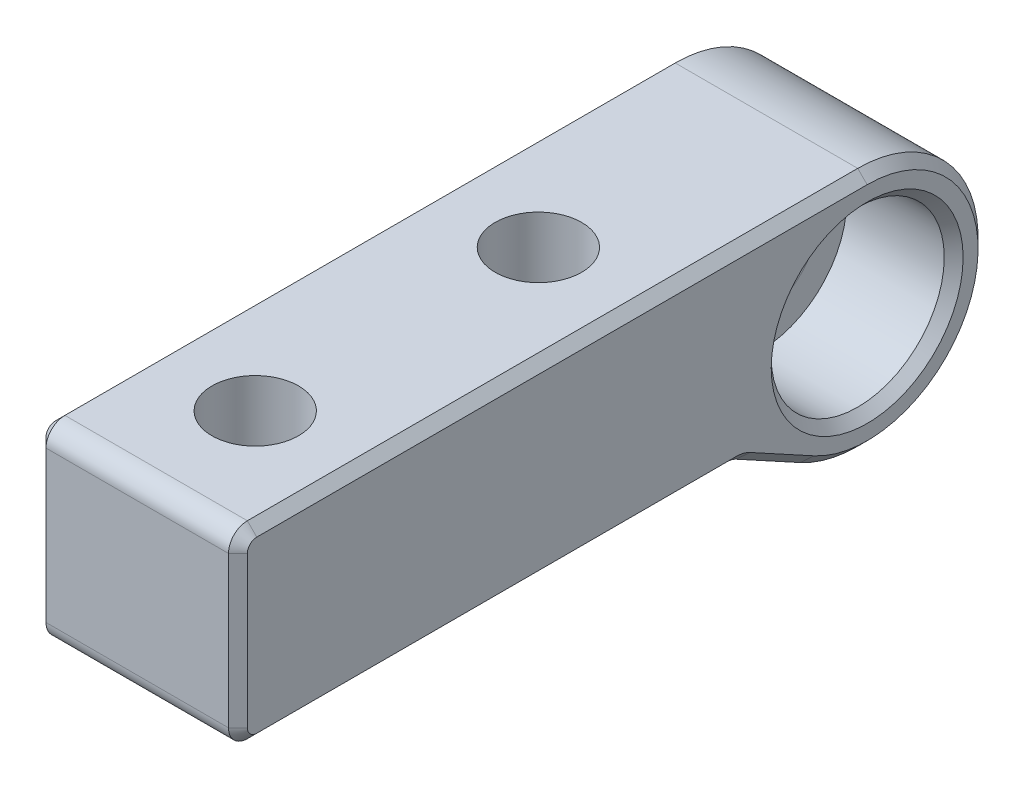
ISO-10303-21;
HEADER;
FILE_DESCRIPTION(('STEP AP214'),'2;1');
FILE_NAME('part.step','',(''),(''),'','','');
FILE_SCHEMA(('AUTOMOTIVE_DESIGN { 1 0 10303 214 1 1 1 1 }'));
ENDSEC;
DATA;
#1=APPLICATION_CONTEXT('core data for automotive mechanical design processes');
#2=APPLICATION_PROTOCOL_DEFINITION('international standard','automotive_design',2000,#1);
#3=PRODUCT_CONTEXT('',#1,'mechanical');
#4=PRODUCT('Part','Part','',(#3));
#5=PRODUCT_RELATED_PRODUCT_CATEGORY('part','',(#4));
#6=PRODUCT_DEFINITION_FORMATION('','',#4);
#7=PRODUCT_DEFINITION_CONTEXT('part definition',#1,'design');
#8=PRODUCT_DEFINITION('design','',#6,#7);
#9=PRODUCT_DEFINITION_SHAPE('','',#8);
#10=(LENGTH_UNIT() NAMED_UNIT(*) SI_UNIT(.MILLI.,.METRE.));
#11=(NAMED_UNIT(*) PLANE_ANGLE_UNIT() SI_UNIT($,.RADIAN.));
#12=(NAMED_UNIT(*) SI_UNIT($,.STERADIAN.) SOLID_ANGLE_UNIT());
#13=UNCERTAINTY_MEASURE_WITH_UNIT(LENGTH_MEASURE(1.E-05),#10,'distance_accuracy_value','');
#14=(GEOMETRIC_REPRESENTATION_CONTEXT(3) GLOBAL_UNCERTAINTY_ASSIGNED_CONTEXT((#13)) GLOBAL_UNIT_ASSIGNED_CONTEXT((#10,
#11,#12)) REPRESENTATION_CONTEXT('',''));
#15=CARTESIAN_POINT('',(0.,0.,0.));
#16=DIRECTION('',(0.,0.,1.));
#17=DIRECTION('',(1.,0.,0.));
#18=AXIS2_PLACEMENT_3D('',#15,#16,#17);
#19=CARTESIAN_POINT('',(12.8,0.,0.));
#20=DIRECTION('',(-1.,0.,0.));
#21=DIRECTION('',(0.,0.,1.));
#22=AXIS2_PLACEMENT_3D('',#19,#20,#21);
#23=CYLINDRICAL_SURFACE('',#22,3.15);
#24=CARTESIAN_POINT('',(5.5,0.,0.));
#25=DIRECTION('',(1.,0.,0.));
#26=DIRECTION('',(0.,0.,-1.));
#27=AXIS2_PLACEMENT_3D('',#24,#25,#26);
#28=CIRCLE('',#27,3.15);
#29=CARTESIAN_POINT('',(5.5,0.,-3.15));
#30=VERTEX_POINT('',#29);
#31=EDGE_CURVE('E45',#30,#30,#28,.T.);
#32=ORIENTED_EDGE('',*,*,#31,.T.);
#33=EDGE_LOOP('',(#32));
#34=FACE_BOUND('',#33,.T.);
#35=CARTESIAN_POINT('',(0.599999999999998,0.,0.));
#36=DIRECTION('',(1.,0.,0.));
#37=DIRECTION('',(0.,0.,-1.));
#38=AXIS2_PLACEMENT_3D('',#35,#36,#37);
#39=CIRCLE('',#38,3.15);
#40=CARTESIAN_POINT('',(0.599999999999998,0.,-3.15));
#41=VERTEX_POINT('',#40);
#42=EDGE_CURVE('E180',#41,#41,#39,.F.);
#43=ORIENTED_EDGE('',*,*,#42,.T.);
#44=EDGE_LOOP('',(#43));
#45=FACE_BOUND('',#44,.T.);
#46=ADVANCED_FACE('F37',(#34,#45),#23,.F.);
#47=CARTESIAN_POINT('',(12.8,0.,0.));
#48=DIRECTION('',(1.,0.,0.));
#49=DIRECTION('',(0.,0.,-1.));
#50=AXIS2_PLACEMENT_3D('',#47,#48,#49);
#51=PLANE('',#50);
#52=DIRECTION('',(0.,-0.478912057387349,-0.877862882965795));
#53=VECTOR('',#52,1.);
#54=CARTESIAN_POINT('',(12.8,-6.18893332490886,3.37633000458081));
#55=LINE('',#54,#53);
#56=CARTESIAN_POINT('',(12.8,-3.96984681066158,7.44399473529363));
#57=VERTEX_POINT('',#56);
#58=CARTESIAN_POINT('',(12.8,-6.18893332490886,3.37633000458081));
#59=VERTEX_POINT('',#58);
#60=EDGE_CURVE('E52',#57,#59,#55,.T.);
#61=ORIENTED_EDGE('',*,*,#60,.T.);
#62=CARTESIAN_POINT('',(12.8,0.,0.));
#63=DIRECTION('',(1.,0.,0.));
#64=DIRECTION('',(0.,0.,-1.));
#65=AXIS2_PLACEMENT_3D('',#62,#63,#64);
#66=CIRCLE('',#65,7.05);
#67=CARTESIAN_POINT('',(12.8,7.05,0.));
#68=VERTEX_POINT('',#67);
#69=EDGE_CURVE('E235',#59,#68,#66,.T.);
#70=ORIENTED_EDGE('',*,*,#69,.T.);
#71=DIRECTION('',(0.,0.,1.));
#72=VECTOR('',#71,1.);
#73=CARTESIAN_POINT('',(12.8,7.05,38.8));
#74=LINE('',#73,#72);
#75=CARTESIAN_POINT('',(12.8,7.05,38.8));
#76=VERTEX_POINT('',#75);
#77=EDGE_CURVE('E223',#68,#76,#74,.T.);
#78=ORIENTED_EDGE('',*,*,#77,.T.);
#79=CARTESIAN_POINT('',(12.8,6.44999999999999,38.8));
#80=DIRECTION('',(1.,0.,0.));
#81=DIRECTION('',(0.,0.,-1.));
#82=AXIS2_PLACEMENT_3D('',#79,#80,#81);
#83=CIRCLE('',#82,0.600000000000003);
#84=CARTESIAN_POINT('',(12.8,6.44999999999999,39.4));
#85=VERTEX_POINT('',#84);
#86=EDGE_CURVE('E225',#76,#85,#83,.T.);
#87=ORIENTED_EDGE('',*,*,#86,.T.);
#88=DIRECTION('',(0.,-1.,0.));
#89=VECTOR('',#88,1.);
#90=CARTESIAN_POINT('',(12.8,-3.15000000000001,39.4));
#91=LINE('',#90,#89);
#92=CARTESIAN_POINT('',(12.8,-3.15000000000001,39.4));
#93=VERTEX_POINT('',#92);
#94=EDGE_CURVE('E227',#85,#93,#91,.T.);
#95=ORIENTED_EDGE('',*,*,#94,.T.);
#96=CARTESIAN_POINT('',(12.8,-3.15000000000001,38.8));
#97=DIRECTION('',(1.,0.,0.));
#98=DIRECTION('',(0.,0.,-1.));
#99=AXIS2_PLACEMENT_3D('',#96,#97,#98);
#100=CIRCLE('',#99,0.600000000000003);
#101=CARTESIAN_POINT('',(12.8,-3.75000000000001,38.8));
#102=VERTEX_POINT('',#101);
#103=EDGE_CURVE('E229',#93,#102,#100,.T.);
#104=ORIENTED_EDGE('',*,*,#103,.T.);
#105=DIRECTION('',(0.,0.,-1.));
#106=VECTOR('',#105,1.);
#107=CARTESIAN_POINT('',(12.8,-3.75000000000001,8.30603643859086));
#108=LINE('',#107,#106);
#109=CARTESIAN_POINT('',(12.8,-3.75000000000001,8.30603643859086));
#110=VERTEX_POINT('',#109);
#111=EDGE_CURVE('E231',#102,#110,#108,.T.);
#112=ORIENTED_EDGE('',*,*,#111,.T.);
#113=CARTESIAN_POINT('',(12.8,-5.55,8.30603643859086));
#114=DIRECTION('',(1.,0.,0.));
#115=DIRECTION('',(0.,0.,-1.));
#116=AXIS2_PLACEMENT_3D('',#113,#114,#115);
#117=CIRCLE('',#116,1.8);
#118=EDGE_CURVE('E57',#110,#57,#117,.F.);
#119=ORIENTED_EDGE('',*,*,#118,.T.);
#120=EDGE_LOOP('',(#61,#70,#78,#87,#95,#104,#112,#119));
#121=FACE_BOUND('',#120,.T.);
#122=CARTESIAN_POINT('',(12.8,0.,0.));
#123=DIRECTION('',(1.,0.,0.));
#124=DIRECTION('',(0.,0.,-1.));
#125=AXIS2_PLACEMENT_3D('',#122,#123,#124);
#126=CIRCLE('',#125,6.10000000000001);
#127=CARTESIAN_POINT('',(12.8,0.,-6.10000000000001));
#128=VERTEX_POINT('',#127);
#129=EDGE_CURVE('E220',#128,#128,#126,.F.);
#130=ORIENTED_EDGE('',*,*,#129,.T.);
#131=EDGE_LOOP('',(#130));
#132=FACE_BOUND('',#131,.T.);
#133=ADVANCED_FACE('F293',(#121,#132),#51,.T.);
#134=CARTESIAN_POINT('',(0.,0.,0.));
#135=DIRECTION('',(1.,0.,0.));
#136=DIRECTION('',(0.,0.,-1.));
#137=AXIS2_PLACEMENT_3D('',#134,#135,#136);
#138=PLANE('',#137);
#139=CARTESIAN_POINT('',(0.,0.,0.));
#140=DIRECTION('',(1.,0.,0.));
#141=DIRECTION('',(0.,0.,-1.));
#142=AXIS2_PLACEMENT_3D('',#139,#140,#141);
#143=CIRCLE('',#142,3.75);
#144=CARTESIAN_POINT('',(0.,0.,-3.75));
#145=VERTEX_POINT('',#144);
#146=EDGE_CURVE('E177',#145,#145,#143,.T.);
#147=ORIENTED_EDGE('',*,*,#146,.T.);
#148=EDGE_LOOP('',(#147));
#149=FACE_BOUND('',#148,.T.);
#150=DIRECTION('',(0.,0.,1.));
#151=VECTOR('',#150,1.);
#152=CARTESIAN_POINT('',(0.,-3.75,0.));
#153=LINE('',#152,#151);
#154=CARTESIAN_POINT('',(0.,-3.75,8.30603643859086));
#155=VERTEX_POINT('',#154);
#156=CARTESIAN_POINT('',(0.,-3.75,38.8));
#157=VERTEX_POINT('',#156);
#158=EDGE_CURVE('E175',#155,#157,#153,.T.);
#159=ORIENTED_EDGE('',*,*,#158,.T.);
#160=CARTESIAN_POINT('',(0.,-3.15000000000001,38.8));
#161=DIRECTION('',(1.,0.,0.));
#162=DIRECTION('',(0.,0.,-1.));
#163=AXIS2_PLACEMENT_3D('',#160,#161,#162);
#164=CIRCLE('',#163,0.599999999999996);
#165=CARTESIAN_POINT('',(0.,-3.15000000000001,39.4));
#166=VERTEX_POINT('',#165);
#167=EDGE_CURVE('E155',#157,#166,#164,.F.);
#168=ORIENTED_EDGE('',*,*,#167,.T.);
#169=DIRECTION('',(0.,1.,0.));
#170=VECTOR('',#169,1.);
#171=CARTESIAN_POINT('',(0.,0.,39.4));
#172=LINE('',#171,#170);
#173=CARTESIAN_POINT('',(0.,6.44999999999999,39.4));
#174=VERTEX_POINT('',#173);
#175=EDGE_CURVE('E164',#166,#174,#172,.T.);
#176=ORIENTED_EDGE('',*,*,#175,.T.);
#177=CARTESIAN_POINT('',(0.,6.44999999999999,38.8));
#178=DIRECTION('',(1.,0.,0.));
#179=DIRECTION('',(0.,0.,-1.));
#180=AXIS2_PLACEMENT_3D('',#177,#178,#179);
#181=CIRCLE('',#180,0.599999999999996);
#182=CARTESIAN_POINT('',(0.,7.04999999999999,38.8));
#183=VERTEX_POINT('',#182);
#184=EDGE_CURVE('E170',#174,#183,#181,.F.);
#185=ORIENTED_EDGE('',*,*,#184,.T.);
#186=DIRECTION('',(0.,0.,-1.));
#187=VECTOR('',#186,1.);
#188=CARTESIAN_POINT('',(0.,7.05,0.));
#189=LINE('',#188,#187);
#190=CARTESIAN_POINT('',(0.,7.05,0.));
#191=VERTEX_POINT('',#190);
#192=EDGE_CURVE('E481',#183,#191,#189,.T.);
#193=ORIENTED_EDGE('',*,*,#192,.T.);
#194=CARTESIAN_POINT('',(0.,0.,0.));
#195=DIRECTION('',(1.,0.,0.));
#196=DIRECTION('',(0.,0.,-1.));
#197=AXIS2_PLACEMENT_3D('',#194,#195,#196);
#198=CIRCLE('',#197,7.05);
#199=CARTESIAN_POINT('',(0.,-6.18893332490885,3.37633000458081));
#200=VERTEX_POINT('',#199);
#201=EDGE_CURVE('E483',#191,#200,#198,.F.);
#202=ORIENTED_EDGE('',*,*,#201,.T.);
#203=DIRECTION('',(0.,0.478912057387349,0.877862882965795));
#204=VECTOR('',#203,1.);
#205=CARTESIAN_POINT('',(0.,-6.18893332490885,3.37633000458081));
#206=LINE('',#205,#204);
#207=CARTESIAN_POINT('',(0.,-3.96984681066157,7.44399473529363));
#208=VERTEX_POINT('',#207);
#209=EDGE_CURVE('E485',#200,#208,#206,.T.);
#210=ORIENTED_EDGE('',*,*,#209,.T.);
#211=CARTESIAN_POINT('',(0.,-5.55,8.30603643859086));
#212=DIRECTION('',(1.,0.,0.));
#213=DIRECTION('',(0.,0.,-1.));
#214=AXIS2_PLACEMENT_3D('',#211,#212,#213);
#215=CIRCLE('',#214,1.8);
#216=EDGE_CURVE('E182',#208,#155,#215,.T.);
#217=ORIENTED_EDGE('',*,*,#216,.T.);
#218=EDGE_LOOP('',(#159,#168,#176,#185,#193,#202,#210,#217));
#219=FACE_BOUND('',#218,.T.);
#220=ADVANCED_FACE('F173',(#149,#219),#138,.F.);
#221=CARTESIAN_POINT('',(12.8,-4.35,8.));
#222=DIRECTION('',(0.,1.,0.));
#223=DIRECTION('',(0.,0.,1.));
#224=AXIS2_PLACEMENT_3D('',#221,#222,#223);
#225=PLANE('',#224);
#226=CARTESIAN_POINT('',(6.4,-4.35,14.5));
#227=DIRECTION('',(0.,-1.,0.));
#228=DIRECTION('',(0.,0.,-1.));
#229=AXIS2_PLACEMENT_3D('',#226,#227,#228);
#230=CIRCLE('',#229,5.);
#231=CARTESIAN_POINT('',(6.4,-4.35,9.5));
#232=VERTEX_POINT('',#231);
#233=EDGE_CURVE('E531',#232,#232,#230,.T.);
#234=ORIENTED_EDGE('',*,*,#233,.F.);
#235=EDGE_LOOP('',(#234));
#236=FACE_BOUND('',#235,.T.);
#237=CARTESIAN_POINT('',(6.4,-4.35000000000001,32.5));
#238=DIRECTION('',(0.,-1.,0.));
#239=DIRECTION('',(0.,0.,-1.));
#240=AXIS2_PLACEMENT_3D('',#237,#238,#239);
#241=CIRCLE('',#240,5.);
#242=CARTESIAN_POINT('',(6.4,-4.35000000000001,27.5));
#243=VERTEX_POINT('',#242);
#244=EDGE_CURVE('E519',#243,#243,#241,.T.);
#245=ORIENTED_EDGE('',*,*,#244,.F.);
#246=EDGE_LOOP('',(#245));
#247=FACE_BOUND('',#246,.T.);
#248=DIRECTION('',(-1.,0.,0.));
#249=VECTOR('',#248,1.);
#250=CARTESIAN_POINT('',(12.8,-4.35000000000001,38.8));
#251=LINE('',#250,#249);
#252=CARTESIAN_POINT('',(12.2,-4.35000000000001,38.8));
#253=VERTEX_POINT('',#252);
#254=CARTESIAN_POINT('',(0.600000000000003,-4.35000000000001,38.8));
#255=VERTEX_POINT('',#254);
#256=EDGE_CURVE('E497',#253,#255,#251,.T.);
#257=ORIENTED_EDGE('',*,*,#256,.T.);
#258=DIRECTION('',(0.,0.,-1.));
#259=VECTOR('',#258,1.);
#260=CARTESIAN_POINT('',(0.600000000000003,-4.35,8.));
#261=LINE('',#260,#259);
#262=CARTESIAN_POINT('',(0.600000000000003,-4.35,8.30603643859086));
#263=VERTEX_POINT('',#262);
#264=EDGE_CURVE('E193',#255,#263,#261,.T.);
#265=ORIENTED_EDGE('',*,*,#264,.T.);
#266=DIRECTION('',(-1.,0.,0.));
#267=VECTOR('',#266,1.);
#268=CARTESIAN_POINT('',(12.8,-4.35,8.30603643859086));
#269=LINE('',#268,#267);
#270=CARTESIAN_POINT('',(12.2,-4.35,8.30603643859086));
#271=VERTEX_POINT('',#270);
#272=EDGE_CURVE('E476',#263,#271,#269,.F.);
#273=ORIENTED_EDGE('',*,*,#272,.T.);
#274=DIRECTION('',(0.,0.,1.));
#275=VECTOR('',#274,1.);
#276=CARTESIAN_POINT('',(12.2,-4.35000000000001,38.8));
#277=LINE('',#276,#275);
#278=EDGE_CURVE('E191',#271,#253,#277,.T.);
#279=ORIENTED_EDGE('',*,*,#278,.T.);
#280=EDGE_LOOP('',(#257,#265,#273,#279));
#281=FACE_BOUND('',#280,.T.);
#282=ADVANCED_FACE('F305',(#236,#247,#281),#225,.F.);
#283=CARTESIAN_POINT('',(12.8,-4.35,8.));
#284=DIRECTION('',(0.,0.877862882965795,-0.478912057387349));
#285=DIRECTION('',(0.,0.478912057387349,0.877862882965795));
#286=AXIS2_PLACEMENT_3D('',#283,#284,#285);
#287=PLANE('',#286);
#288=DIRECTION('',(-1.,0.,0.));
#289=VECTOR('',#288,1.);
#290=CARTESIAN_POINT('',(0.,-4.49656454044105,7.73134196972604));
#291=LINE('',#290,#289);
#292=CARTESIAN_POINT('',(12.2,-4.49656454044105,7.73134196972604));
#293=VERTEX_POINT('',#292);
#294=CARTESIAN_POINT('',(0.600000000000003,-4.49656454044105,7.73134196972604));
#295=VERTEX_POINT('',#294);
#296=EDGE_CURVE('E499',#293,#295,#291,.T.);
#297=ORIENTED_EDGE('',*,*,#296,.T.);
#298=DIRECTION('',(0.,-0.478912057387349,-0.877862882965795));
#299=VECTOR('',#298,1.);
#300=CARTESIAN_POINT('',(0.600000000000003,-4.35,8.));
#301=LINE('',#300,#299);
#302=CARTESIAN_POINT('',(0.600000000000003,-6.71565105468833,3.66367723901322));
#303=VERTEX_POINT('',#302);
#304=EDGE_CURVE('E201',#295,#303,#301,.T.);
#305=ORIENTED_EDGE('',*,*,#304,.T.);
#306=DIRECTION('',(-1.,0.,0.));
#307=VECTOR('',#306,1.);
#308=CARTESIAN_POINT('',(12.8,-6.71565105468833,3.66367723901322));
#309=LINE('',#308,#307);
#310=CARTESIAN_POINT('',(12.2,-6.71565105468833,3.66367723901322));
#311=VERTEX_POINT('',#310);
#312=EDGE_CURVE('E502',#311,#303,#309,.T.);
#313=ORIENTED_EDGE('',*,*,#312,.F.);
#314=DIRECTION('',(0.,0.478912057387349,0.877862882965795));
#315=VECTOR('',#314,1.);
#316=CARTESIAN_POINT('',(12.2,-4.49656454044105,7.73134196972604));
#317=LINE('',#316,#315);
#318=EDGE_CURVE('E199',#311,#293,#317,.T.);
#319=ORIENTED_EDGE('',*,*,#318,.T.);
#320=EDGE_LOOP('',(#297,#305,#313,#319));
#321=FACE_BOUND('',#320,.T.);
#322=ADVANCED_FACE('F318',(#321),#287,.F.);
#323=CARTESIAN_POINT('',(12.8,0.,0.));
#324=DIRECTION('',(-1.,0.,0.));
#325=DIRECTION('',(0.,0.,1.));
#326=AXIS2_PLACEMENT_3D('',#323,#324,#325);
#327=CYLINDRICAL_SURFACE('',#326,7.65);
#328=ORIENTED_EDGE('',*,*,#312,.T.);
#329=CARTESIAN_POINT('',(0.600000000000003,0.,0.));
#330=DIRECTION('',(1.,0.,0.));
#331=DIRECTION('',(0.,0.,-1.));
#332=AXIS2_PLACEMENT_3D('',#329,#330,#331);
#333=CIRCLE('',#332,7.65);
#334=CARTESIAN_POINT('',(0.600000000000003,7.65,0.));
#335=VERTEX_POINT('',#334);
#336=EDGE_CURVE('E206',#303,#335,#333,.T.);
#337=ORIENTED_EDGE('',*,*,#336,.T.);
#338=DIRECTION('',(-1.,0.,0.));
#339=VECTOR('',#338,1.);
#340=CARTESIAN_POINT('',(12.8,7.65,0.));
#341=LINE('',#340,#339);
#342=CARTESIAN_POINT('',(12.2,7.65,0.));
#343=VERTEX_POINT('',#342);
#344=EDGE_CURVE('E507',#343,#335,#341,.T.);
#345=ORIENTED_EDGE('',*,*,#344,.F.);
#346=CARTESIAN_POINT('',(12.2,0.,0.));
#347=DIRECTION('',(1.,0.,0.));
#348=DIRECTION('',(0.,0.,-1.));
#349=AXIS2_PLACEMENT_3D('',#346,#347,#348);
#350=CIRCLE('',#349,7.65);
#351=EDGE_CURVE('E203',#343,#311,#350,.F.);
#352=ORIENTED_EDGE('',*,*,#351,.T.);
#353=EDGE_LOOP('',(#328,#337,#345,#352));
#354=FACE_BOUND('',#353,.T.);
#355=ADVANCED_FACE('F314',(#354),#327,.T.);
#356=CARTESIAN_POINT('',(12.8,7.65,0.));
#357=DIRECTION('',(0.,-1.,0.));
#358=DIRECTION('',(0.,0.,-1.));
#359=AXIS2_PLACEMENT_3D('',#356,#357,#358);
#360=PLANE('',#359);
#361=CARTESIAN_POINT('',(6.4,7.65,14.5));
#362=DIRECTION('',(0.,-1.,0.));
#363=DIRECTION('',(0.,0.,-1.));
#364=AXIS2_PLACEMENT_3D('',#361,#362,#363);
#365=CIRCLE('',#364,2.75);
#366=CARTESIAN_POINT('',(6.4,7.65,11.75));
#367=VERTEX_POINT('',#366);
#368=EDGE_CURVE('E522',#367,#367,#365,.T.);
#369=ORIENTED_EDGE('',*,*,#368,.T.);
#370=EDGE_LOOP('',(#369));
#371=FACE_BOUND('',#370,.T.);
#372=CARTESIAN_POINT('',(6.4,7.65,32.5));
#373=DIRECTION('',(0.,-1.,0.));
#374=DIRECTION('',(0.,0.,-1.));
#375=AXIS2_PLACEMENT_3D('',#372,#373,#374);
#376=CIRCLE('',#375,2.75);
#377=CARTESIAN_POINT('',(6.4,7.65,29.75));
#378=VERTEX_POINT('',#377);
#379=EDGE_CURVE('E510',#378,#378,#376,.T.);
#380=ORIENTED_EDGE('',*,*,#379,.T.);
#381=EDGE_LOOP('',(#380));
#382=FACE_BOUND('',#381,.T.);
#383=ORIENTED_EDGE('',*,*,#344,.T.);
#384=DIRECTION('',(0.,0.,1.));
#385=VECTOR('',#384,1.);
#386=CARTESIAN_POINT('',(0.600000000000003,7.65,0.));
#387=LINE('',#386,#385);
#388=CARTESIAN_POINT('',(0.600000000000003,7.64999999999999,38.8));
#389=VERTEX_POINT('',#388);
#390=EDGE_CURVE('E210',#335,#389,#387,.T.);
#391=ORIENTED_EDGE('',*,*,#390,.T.);
#392=DIRECTION('',(-1.,0.,0.));
#393=VECTOR('',#392,1.);
#394=CARTESIAN_POINT('',(12.8,7.64999999999999,38.8));
#395=LINE('',#394,#393);
#396=CARTESIAN_POINT('',(12.2,7.64999999999999,38.8));
#397=VERTEX_POINT('',#396);
#398=EDGE_CURVE('E171',#389,#397,#395,.F.);
#399=ORIENTED_EDGE('',*,*,#398,.T.);
#400=DIRECTION('',(0.,0.,-1.));
#401=VECTOR('',#400,1.);
#402=CARTESIAN_POINT('',(12.2,7.65,0.));
#403=LINE('',#402,#401);
#404=EDGE_CURVE('E208',#397,#343,#403,.T.);
#405=ORIENTED_EDGE('',*,*,#404,.T.);
#406=EDGE_LOOP('',(#383,#391,#399,#405));
#407=FACE_BOUND('',#406,.T.);
#408=ADVANCED_FACE('F310',(#371,#382,#407),#360,.F.);
#409=CARTESIAN_POINT('',(12.8,-4.35000000000001,40.));
#410=DIRECTION('',(0.,0.,-1.));
#411=DIRECTION('',(-1.,0.,0.));
#412=AXIS2_PLACEMENT_3D('',#409,#410,#411);
#413=PLANE('',#412);
#414=DIRECTION('',(-1.,0.,0.));
#415=VECTOR('',#414,1.);
#416=CARTESIAN_POINT('',(12.8,6.44999999999999,40.));
#417=LINE('',#416,#415);
#418=CARTESIAN_POINT('',(12.2,6.44999999999999,40.));
#419=VERTEX_POINT('',#418);
#420=CARTESIAN_POINT('',(0.600000000000003,6.44999999999999,40.));
#421=VERTEX_POINT('',#420);
#422=EDGE_CURVE('E468',#419,#421,#417,.T.);
#423=ORIENTED_EDGE('',*,*,#422,.T.);
#424=DIRECTION('',(0.,-1.,0.));
#425=VECTOR('',#424,1.);
#426=CARTESIAN_POINT('',(0.600000000000003,-4.35000000000001,40.));
#427=LINE('',#426,#425);
#428=CARTESIAN_POINT('',(0.600000000000003,-3.15000000000001,40.));
#429=VERTEX_POINT('',#428);
#430=EDGE_CURVE('E218',#421,#429,#427,.T.);
#431=ORIENTED_EDGE('',*,*,#430,.T.);
#432=DIRECTION('',(-1.,0.,0.));
#433=VECTOR('',#432,1.);
#434=CARTESIAN_POINT('',(12.8,-3.15000000000001,40.));
#435=LINE('',#434,#433);
#436=CARTESIAN_POINT('',(12.2,-3.15000000000001,40.));
#437=VERTEX_POINT('',#436);
#438=EDGE_CURVE('E470',#429,#437,#435,.F.);
#439=ORIENTED_EDGE('',*,*,#438,.T.);
#440=DIRECTION('',(0.,1.,0.));
#441=VECTOR('',#440,1.);
#442=CARTESIAN_POINT('',(12.2,6.44999999999999,40.));
#443=LINE('',#442,#441);
#444=EDGE_CURVE('E216',#437,#419,#443,.T.);
#445=ORIENTED_EDGE('',*,*,#444,.T.);
#446=EDGE_LOOP('',(#423,#431,#439,#445));
#447=FACE_BOUND('',#446,.T.);
#448=ADVANCED_FACE('F307',(#447),#413,.F.);
#449=CARTESIAN_POINT('',(6.4,-4.35000000000001,32.5));
#450=DIRECTION('',(0.,-1.,0.));
#451=DIRECTION('',(0.,0.,-1.));
#452=AXIS2_PLACEMENT_3D('',#449,#450,#451);
#453=CYLINDRICAL_SURFACE('',#452,2.75);
#454=ORIENTED_EDGE('',*,*,#379,.F.);
#455=EDGE_LOOP('',(#454));
#456=FACE_BOUND('',#455,.T.);
#457=CARTESIAN_POINT('',(6.4,1.14999999999999,32.5));
#458=DIRECTION('',(0.,-1.,0.));
#459=DIRECTION('',(0.,0.,-1.));
#460=AXIS2_PLACEMENT_3D('',#457,#458,#459);
#461=CIRCLE('',#460,2.75);
#462=CARTESIAN_POINT('',(6.4,1.14999999999999,29.75));
#463=VERTEX_POINT('',#462);
#464=EDGE_CURVE('E513',#463,#463,#461,.T.);
#465=ORIENTED_EDGE('',*,*,#464,.T.);
#466=EDGE_LOOP('',(#465));
#467=FACE_BOUND('',#466,.T.);
#468=ADVANCED_FACE('F300',(#456,#467),#453,.F.);
#469=CARTESIAN_POINT('',(9.15,1.14999999999999,32.5));
#470=DIRECTION('',(0.,1.,0.));
#471=DIRECTION('',(0.,0.,1.));
#472=AXIS2_PLACEMENT_3D('',#469,#470,#471);
#473=PLANE('',#472);
#474=ORIENTED_EDGE('',*,*,#464,.F.);
#475=EDGE_LOOP('',(#474));
#476=FACE_BOUND('',#475,.T.);
#477=CARTESIAN_POINT('',(6.4,1.14999999999999,32.5));
#478=DIRECTION('',(0.,-1.,0.));
#479=DIRECTION('',(0.,0.,-1.));
#480=AXIS2_PLACEMENT_3D('',#477,#478,#479);
#481=CIRCLE('',#480,5.);
#482=CARTESIAN_POINT('',(6.4,1.14999999999999,27.5));
#483=VERTEX_POINT('',#482);
#484=EDGE_CURVE('E516',#483,#483,#481,.T.);
#485=ORIENTED_EDGE('',*,*,#484,.T.);
#486=EDGE_LOOP('',(#485));
#487=FACE_BOUND('',#486,.T.);
#488=ADVANCED_FACE('F562',(#476,#487),#473,.F.);
#489=CARTESIAN_POINT('',(6.4,-4.35000000000001,32.5));
#490=DIRECTION('',(0.,-1.,0.));
#491=DIRECTION('',(0.,0.,-1.));
#492=AXIS2_PLACEMENT_3D('',#489,#490,#491);
#493=CYLINDRICAL_SURFACE('',#492,5.);
#494=ORIENTED_EDGE('',*,*,#484,.F.);
#495=EDGE_LOOP('',(#494));
#496=FACE_BOUND('',#495,.T.);
#497=ORIENTED_EDGE('',*,*,#244,.T.);
#498=EDGE_LOOP('',(#497));
#499=FACE_BOUND('',#498,.T.);
#500=ADVANCED_FACE('F559',(#496,#499),#493,.F.);
#501=CARTESIAN_POINT('',(6.4,-4.35,14.5));
#502=DIRECTION('',(0.,-1.,0.));
#503=DIRECTION('',(0.,0.,-1.));
#504=AXIS2_PLACEMENT_3D('',#501,#502,#503);
#505=CYLINDRICAL_SURFACE('',#504,2.75);
#506=ORIENTED_EDGE('',*,*,#368,.F.);
#507=EDGE_LOOP('',(#506));
#508=FACE_BOUND('',#507,.T.);
#509=CARTESIAN_POINT('',(6.4,1.15,14.5));
#510=DIRECTION('',(0.,-1.,0.));
#511=DIRECTION('',(0.,0.,-1.));
#512=AXIS2_PLACEMENT_3D('',#509,#510,#511);
#513=CIRCLE('',#512,2.75);
#514=CARTESIAN_POINT('',(6.4,1.15,11.75));
#515=VERTEX_POINT('',#514);
#516=EDGE_CURVE('E525',#515,#515,#513,.T.);
#517=ORIENTED_EDGE('',*,*,#516,.T.);
#518=EDGE_LOOP('',(#517));
#519=FACE_BOUND('',#518,.T.);
#520=ADVANCED_FACE('F555',(#508,#519),#505,.F.);
#521=CARTESIAN_POINT('',(9.15,1.15,14.5));
#522=DIRECTION('',(0.,1.,0.));
#523=DIRECTION('',(0.,0.,1.));
#524=AXIS2_PLACEMENT_3D('',#521,#522,#523);
#525=PLANE('',#524);
#526=ORIENTED_EDGE('',*,*,#516,.F.);
#527=EDGE_LOOP('',(#526));
#528=FACE_BOUND('',#527,.T.);
#529=CARTESIAN_POINT('',(6.4,1.15,14.5));
#530=DIRECTION('',(0.,-1.,0.));
#531=DIRECTION('',(0.,0.,-1.));
#532=AXIS2_PLACEMENT_3D('',#529,#530,#531);
#533=CIRCLE('',#532,5.);
#534=CARTESIAN_POINT('',(6.4,1.15,9.50000000000001));
#535=VERTEX_POINT('',#534);
#536=EDGE_CURVE('E528',#535,#535,#533,.T.);
#537=ORIENTED_EDGE('',*,*,#536,.T.);
#538=EDGE_LOOP('',(#537));
#539=FACE_BOUND('',#538,.T.);
#540=ADVANCED_FACE('F551',(#528,#539),#525,.F.);
#541=CARTESIAN_POINT('',(6.4,-4.35,14.5));
#542=DIRECTION('',(0.,-1.,0.));
#543=DIRECTION('',(0.,0.,-1.));
#544=AXIS2_PLACEMENT_3D('',#541,#542,#543);
#545=CYLINDRICAL_SURFACE('',#544,5.);
#546=ORIENTED_EDGE('',*,*,#536,.F.);
#547=EDGE_LOOP('',(#546));
#548=FACE_BOUND('',#547,.T.);
#549=ORIENTED_EDGE('',*,*,#233,.T.);
#550=EDGE_LOOP('',(#549));
#551=FACE_BOUND('',#550,.T.);
#552=ADVANCED_FACE('F545',(#548,#551),#545,.F.);
#553=CARTESIAN_POINT('',(-15.556349186104,0.,0.));
#554=DIRECTION('',(1.,0.,0.));
#555=DIRECTION('',(0.,0.,-1.));
#556=AXIS2_PLACEMENT_3D('',#553,#554,#555);
#557=CYLINDRICAL_SURFACE('',#556,5.5);
#558=CARTESIAN_POINT('',(12.2,0.,0.));
#559=DIRECTION('',(1.,0.,0.));
#560=DIRECTION('',(0.,0.,-1.));
#561=AXIS2_PLACEMENT_3D('',#558,#559,#560);
#562=CIRCLE('',#561,5.5);
#563=CARTESIAN_POINT('',(12.2,0.,-5.5));
#564=VERTEX_POINT('',#563);
#565=EDGE_CURVE('E237',#564,#564,#562,.T.);
#566=ORIENTED_EDGE('',*,*,#565,.T.);
#567=EDGE_LOOP('',(#566));
#568=FACE_BOUND('',#567,.T.);
#569=CARTESIAN_POINT('',(6.,0.,0.));
#570=DIRECTION('',(1.,0.,0.));
#571=DIRECTION('',(0.,0.,-1.));
#572=AXIS2_PLACEMENT_3D('',#569,#570,#571);
#573=CIRCLE('',#572,5.5);
#574=CARTESIAN_POINT('',(6.,0.,-5.5));
#575=VERTEX_POINT('',#574);
#576=EDGE_CURVE('E257',#575,#575,#573,.F.);
#577=ORIENTED_EDGE('',*,*,#576,.T.);
#578=EDGE_LOOP('',(#577));
#579=FACE_BOUND('',#578,.T.);
#580=ADVANCED_FACE('F537',(#568,#579),#557,.F.);
#581=CARTESIAN_POINT('',(6.,0.,0.));
#582=DIRECTION('',(1.,0.,0.));
#583=DIRECTION('',(0.,0.,-1.));
#584=AXIS2_PLACEMENT_3D('',#581,#582,#583);
#585=PLANE('',#584);
#586=CARTESIAN_POINT('',(6.,0.,0.));
#587=DIRECTION('',(1.,0.,0.));
#588=DIRECTION('',(0.,0.,-1.));
#589=AXIS2_PLACEMENT_3D('',#586,#587,#588);
#590=CIRCLE('',#589,3.65);
#591=CARTESIAN_POINT('',(6.,0.,-3.65));
#592=VERTEX_POINT('',#591);
#593=EDGE_CURVE('E12',#592,#592,#590,.F.);
#594=ORIENTED_EDGE('',*,*,#593,.T.);
#595=EDGE_LOOP('',(#594));
#596=FACE_BOUND('',#595,.T.);
#597=ORIENTED_EDGE('',*,*,#576,.F.);
#598=EDGE_LOOP('',(#597));
#599=FACE_BOUND('',#598,.T.);
#600=ADVANCED_FACE('F330',(#596,#599),#585,.T.);
#601=CARTESIAN_POINT('',(12.8,-5.55,8.30603643859086));
#602=DIRECTION('',(1.,0.,0.));
#603=DIRECTION('',(0.,0.,-1.));
#604=AXIS2_PLACEMENT_3D('',#601,#602,#603);
#605=CYLINDRICAL_SURFACE('',#604,1.2);
#606=ORIENTED_EDGE('',*,*,#272,.F.);
#607=CARTESIAN_POINT('',(0.600000000000003,-5.55,8.30603643859086));
#608=DIRECTION('',(1.,0.,0.));
#609=DIRECTION('',(0.,0.,-1.));
#610=AXIS2_PLACEMENT_3D('',#607,#608,#609);
#611=CIRCLE('',#610,1.2);
#612=EDGE_CURVE('E197',#263,#295,#611,.F.);
#613=ORIENTED_EDGE('',*,*,#612,.T.);
#614=ORIENTED_EDGE('',*,*,#296,.F.);
#615=CARTESIAN_POINT('',(12.2,-5.55,8.30603643859086));
#616=DIRECTION('',(1.,0.,0.));
#617=DIRECTION('',(0.,0.,-1.));
#618=AXIS2_PLACEMENT_3D('',#615,#616,#617);
#619=CIRCLE('',#618,1.2);
#620=EDGE_CURVE('E195',#293,#271,#619,.T.);
#621=ORIENTED_EDGE('',*,*,#620,.T.);
#622=EDGE_LOOP('',(#606,#613,#614,#621));
#623=FACE_BOUND('',#622,.T.);
#624=ADVANCED_FACE('F326',(#623),#605,.F.);
#625=CARTESIAN_POINT('',(12.8,6.44999999999999,38.8));
#626=DIRECTION('',(-1.,0.,0.));
#627=DIRECTION('',(0.,0.,1.));
#628=AXIS2_PLACEMENT_3D('',#625,#626,#627);
#629=CYLINDRICAL_SURFACE('',#628,1.2);
#630=ORIENTED_EDGE('',*,*,#398,.F.);
#631=CARTESIAN_POINT('',(0.600000000000003,6.44999999999999,38.8));
#632=DIRECTION('',(1.,0.,0.));
#633=DIRECTION('',(0.,0.,-1.));
#634=AXIS2_PLACEMENT_3D('',#631,#632,#633);
#635=CIRCLE('',#634,1.2);
#636=EDGE_CURVE('E214',#389,#421,#635,.T.);
#637=ORIENTED_EDGE('',*,*,#636,.T.);
#638=ORIENTED_EDGE('',*,*,#422,.F.);
#639=CARTESIAN_POINT('',(12.2,6.44999999999999,38.8));
#640=DIRECTION('',(1.,0.,0.));
#641=DIRECTION('',(0.,0.,-1.));
#642=AXIS2_PLACEMENT_3D('',#639,#640,#641);
#643=CIRCLE('',#642,1.2);
#644=EDGE_CURVE('E212',#419,#397,#643,.F.);
#645=ORIENTED_EDGE('',*,*,#644,.T.);
#646=EDGE_LOOP('',(#630,#637,#638,#645));
#647=FACE_BOUND('',#646,.T.);
#648=ADVANCED_FACE('F329',(#647),#629,.T.);
#649=CARTESIAN_POINT('',(12.8,-3.15000000000001,38.8));
#650=DIRECTION('',(-1.,0.,0.));
#651=DIRECTION('',(0.,0.,1.));
#652=AXIS2_PLACEMENT_3D('',#649,#650,#651);
#653=CYLINDRICAL_SURFACE('',#652,1.2);
#654=ORIENTED_EDGE('',*,*,#438,.F.);
#655=CARTESIAN_POINT('',(0.600000000000003,-3.15000000000001,38.8));
#656=DIRECTION('',(1.,0.,0.));
#657=DIRECTION('',(0.,0.,-1.));
#658=AXIS2_PLACEMENT_3D('',#655,#656,#657);
#659=CIRCLE('',#658,1.2);
#660=EDGE_CURVE('E157',#429,#255,#659,.T.);
#661=ORIENTED_EDGE('',*,*,#660,.T.);
#662=ORIENTED_EDGE('',*,*,#256,.F.);
#663=CARTESIAN_POINT('',(12.2,-3.15000000000001,38.8));
#664=DIRECTION('',(1.,0.,0.));
#665=DIRECTION('',(0.,0.,-1.));
#666=AXIS2_PLACEMENT_3D('',#663,#664,#665);
#667=CIRCLE('',#666,1.2);
#668=EDGE_CURVE('E188',#253,#437,#667,.F.);
#669=ORIENTED_EDGE('',*,*,#668,.T.);
#670=EDGE_LOOP('',(#654,#661,#662,#669));
#671=FACE_BOUND('',#670,.T.);
#672=ADVANCED_FACE('F334',(#671),#653,.T.);
#673=CARTESIAN_POINT('',(0.,0.,0.));
#674=DIRECTION('',(-1.,0.,0.));
#675=DIRECTION('',(0.,0.,1.));
#676=AXIS2_PLACEMENT_3D('',#673,#674,#675);
#677=CONICAL_SURFACE('',#676,3.75,0.785398163397447);
#678=ORIENTED_EDGE('',*,*,#42,.F.);
#679=EDGE_LOOP('',(#678));
#680=FACE_BOUND('',#679,.T.);
#681=ORIENTED_EDGE('',*,*,#146,.F.);
#682=EDGE_LOOP('',(#681));
#683=FACE_BOUND('',#682,.T.);
#684=ADVANCED_FACE('F338',(#680,#683),#677,.F.);
#685=CARTESIAN_POINT('',(0.600000000000003,0.,0.));
#686=DIRECTION('',(1.,0.,0.));
#687=DIRECTION('',(0.,0.,-1.));
#688=AXIS2_PLACEMENT_3D('',#685,#686,#687);
#689=CONICAL_SURFACE('',#688,7.65,0.785398163397448);
#690=DIRECTION('',(-0.707106781186548,-0.707106781186548,0.));
#691=VECTOR('',#690,1.);
#692=CARTESIAN_POINT('',(0.600000000000003,7.65,0.));
#693=LINE('',#692,#691);
#694=EDGE_CURVE('E251',#335,#191,#693,.T.);
#695=ORIENTED_EDGE('',*,*,#694,.F.);
#696=ORIENTED_EDGE('',*,*,#336,.F.);
#697=DIRECTION('',(0.707106781186548,-0.620742797497086,0.338641963370595));
#698=VECTOR('',#697,1.);
#699=CARTESIAN_POINT('',(0.,-6.18893332490885,3.37633000458081));
#700=LINE('',#699,#698);
#701=EDGE_CURVE('E254',#200,#303,#700,.T.);
#702=ORIENTED_EDGE('',*,*,#701,.F.);
#703=ORIENTED_EDGE('',*,*,#201,.F.);
#704=EDGE_LOOP('',(#695,#696,#702,#703));
#705=FACE_BOUND('',#704,.T.);
#706=ADVANCED_FACE('F346',(#705),#689,.T.);
#707=CARTESIAN_POINT('',(0.600000000000003,-4.35,8.));
#708=DIRECTION('',(0.707106781186547,0.620742797497086,-0.338641963370595));
#709=DIRECTION('',(0.,-0.478912057387349,-0.877862882965795));
#710=AXIS2_PLACEMENT_3D('',#707,#708,#709);
#711=PLANE('',#710);
#712=ORIENTED_EDGE('',*,*,#701,.T.);
#713=ORIENTED_EDGE('',*,*,#304,.F.);
#714=DIRECTION('',(0.707106781186547,-0.620742797497086,0.338641963370595));
#715=VECTOR('',#714,1.);
#716=CARTESIAN_POINT('',(0.,-3.96984681066157,7.44399473529363));
#717=LINE('',#716,#715);
#718=EDGE_CURVE('E248',#208,#295,#717,.T.);
#719=ORIENTED_EDGE('',*,*,#718,.F.);
#720=ORIENTED_EDGE('',*,*,#209,.F.);
#721=EDGE_LOOP('',(#712,#713,#719,#720));
#722=FACE_BOUND('',#721,.T.);
#723=ADVANCED_FACE('F388',(#722),#711,.F.);
#724=CARTESIAN_POINT('',(0.600000000000003,7.65,0.));
#725=DIRECTION('',(0.707106781186548,-0.707106781186548,0.));
#726=DIRECTION('',(0.,0.,1.));
#727=AXIS2_PLACEMENT_3D('',#724,#725,#726);
#728=PLANE('',#727);
#729=ORIENTED_EDGE('',*,*,#694,.T.);
#730=ORIENTED_EDGE('',*,*,#192,.F.);
#731=DIRECTION('',(-0.707106781186547,-0.707106781186548,0.));
#732=VECTOR('',#731,1.);
#733=CARTESIAN_POINT('',(0.600000000000003,7.64999999999999,38.8));
#734=LINE('',#733,#732);
#735=EDGE_CURVE('E245',#389,#183,#734,.T.);
#736=ORIENTED_EDGE('',*,*,#735,.F.);
#737=ORIENTED_EDGE('',*,*,#390,.F.);
#738=EDGE_LOOP('',(#729,#730,#736,#737));
#739=FACE_BOUND('',#738,.T.);
#740=ADVANCED_FACE('F381',(#739),#728,.F.);
#741=CARTESIAN_POINT('',(0.,-5.55,8.30603643859086));
#742=DIRECTION('',(-1.,0.,0.));
#743=DIRECTION('',(0.,0.,1.));
#744=AXIS2_PLACEMENT_3D('',#741,#742,#743);
#745=CONICAL_SURFACE('',#744,1.8,0.785398163397448);
#746=ORIENTED_EDGE('',*,*,#718,.T.);
#747=ORIENTED_EDGE('',*,*,#612,.F.);
#748=DIRECTION('',(0.707106781186548,-0.707106781186548,0.));
#749=VECTOR('',#748,1.);
#750=CARTESIAN_POINT('',(0.,-3.75,8.30603643859086));
#751=LINE('',#750,#749);
#752=EDGE_CURVE('E242',#155,#263,#751,.T.);
#753=ORIENTED_EDGE('',*,*,#752,.F.);
#754=ORIENTED_EDGE('',*,*,#216,.F.);
#755=EDGE_LOOP('',(#746,#747,#753,#754));
#756=FACE_BOUND('',#755,.T.);
#757=ADVANCED_FACE('F374',(#756),#745,.F.);
#758=CARTESIAN_POINT('',(0.,6.44999999999999,38.8));
#759=DIRECTION('',(1.,0.,0.));
#760=DIRECTION('',(0.,0.,-1.));
#761=AXIS2_PLACEMENT_3D('',#758,#759,#760);
#762=CONICAL_SURFACE('',#761,0.599999999999996,0.785398163397449);
#763=ORIENTED_EDGE('',*,*,#735,.T.);
#764=ORIENTED_EDGE('',*,*,#184,.F.);
#765=DIRECTION('',(-0.707106781186548,0.,-0.707106781186548));
#766=VECTOR('',#765,1.);
#767=CARTESIAN_POINT('',(0.600000000000003,6.44999999999999,40.));
#768=LINE('',#767,#766);
#769=EDGE_CURVE('E167',#421,#174,#768,.T.);
#770=ORIENTED_EDGE('',*,*,#769,.F.);
#771=ORIENTED_EDGE('',*,*,#636,.F.);
#772=EDGE_LOOP('',(#763,#764,#770,#771));
#773=FACE_BOUND('',#772,.T.);
#774=ADVANCED_FACE('F367',(#773),#762,.T.);
#775=CARTESIAN_POINT('',(0.600000000000003,-4.35,8.));
#776=DIRECTION('',(0.707106781186547,0.707106781186548,0.));
#777=DIRECTION('',(0.,0.,-1.));
#778=AXIS2_PLACEMENT_3D('',#775,#776,#777);
#779=PLANE('',#778);
#780=ORIENTED_EDGE('',*,*,#752,.T.);
#781=ORIENTED_EDGE('',*,*,#264,.F.);
#782=DIRECTION('',(0.707106781186548,-0.707106781186548,0.));
#783=VECTOR('',#782,1.);
#784=CARTESIAN_POINT('',(0.,-3.75,38.8));
#785=LINE('',#784,#783);
#786=EDGE_CURVE('E160',#157,#255,#785,.T.);
#787=ORIENTED_EDGE('',*,*,#786,.F.);
#788=ORIENTED_EDGE('',*,*,#158,.F.);
#789=EDGE_LOOP('',(#780,#781,#787,#788));
#790=FACE_BOUND('',#789,.T.);
#791=ADVANCED_FACE('F361',(#790),#779,.F.);
#792=CARTESIAN_POINT('',(0.600000000000003,-4.35000000000001,40.));
#793=DIRECTION('',(0.707106781186548,0.,-0.707106781186548));
#794=DIRECTION('',(0.,-1.,0.));
#795=AXIS2_PLACEMENT_3D('',#792,#793,#794);
#796=PLANE('',#795);
#797=ORIENTED_EDGE('',*,*,#769,.T.);
#798=ORIENTED_EDGE('',*,*,#175,.F.);
#799=DIRECTION('',(-0.707106781186548,0.,-0.707106781186548));
#800=VECTOR('',#799,1.);
#801=CARTESIAN_POINT('',(0.600000000000003,-3.15000000000001,40.));
#802=LINE('',#801,#800);
#803=EDGE_CURVE('E151',#429,#166,#802,.T.);
#804=ORIENTED_EDGE('',*,*,#803,.F.);
#805=ORIENTED_EDGE('',*,*,#430,.F.);
#806=EDGE_LOOP('',(#797,#798,#804,#805));
#807=FACE_BOUND('',#806,.T.);
#808=ADVANCED_FACE('F165',(#807),#796,.F.);
#809=CARTESIAN_POINT('',(0.,-3.15000000000001,38.8));
#810=DIRECTION('',(1.,0.,0.));
#811=DIRECTION('',(0.,0.,-1.));
#812=AXIS2_PLACEMENT_3D('',#809,#810,#811);
#813=CONICAL_SURFACE('',#812,0.599999999999996,0.785398163397449);
#814=ORIENTED_EDGE('',*,*,#786,.T.);
#815=ORIENTED_EDGE('',*,*,#660,.F.);
#816=ORIENTED_EDGE('',*,*,#803,.T.);
#817=ORIENTED_EDGE('',*,*,#167,.F.);
#818=EDGE_LOOP('',(#814,#815,#816,#817));
#819=FACE_BOUND('',#818,.T.);
#820=ADVANCED_FACE('F153',(#819),#813,.T.);
#821=CARTESIAN_POINT('',(12.8,-3.15000000000001,38.8));
#822=DIRECTION('',(-1.,0.,0.));
#823=DIRECTION('',(0.,0.,1.));
#824=AXIS2_PLACEMENT_3D('',#821,#822,#823);
#825=CONICAL_SURFACE('',#824,0.600000000000003,0.785398163397443);
#826=DIRECTION('',(0.707106781186552,0.,-0.707106781186543));
#827=VECTOR('',#826,1.);
#828=CARTESIAN_POINT('',(12.2,-3.15000000000001,40.));
#829=LINE('',#828,#827);
#830=EDGE_CURVE('E274',#437,#93,#829,.T.);
#831=ORIENTED_EDGE('',*,*,#830,.F.);
#832=ORIENTED_EDGE('',*,*,#668,.F.);
#833=DIRECTION('',(-0.707106781186552,-0.707106781186543,0.));
#834=VECTOR('',#833,1.);
#835=CARTESIAN_POINT('',(12.8,-3.75000000000001,38.8));
#836=LINE('',#835,#834);
#837=EDGE_CURVE('E161',#102,#253,#836,.T.);
#838=ORIENTED_EDGE('',*,*,#837,.F.);
#839=ORIENTED_EDGE('',*,*,#103,.F.);
#840=EDGE_LOOP('',(#831,#832,#838,#839));
#841=FACE_BOUND('',#840,.T.);
#842=ADVANCED_FACE('F355',(#841),#825,.T.);
#843=CARTESIAN_POINT('',(12.8,-3.75,0.));
#844=DIRECTION('',(0.707106781186543,-0.707106781186552,0.));
#845=DIRECTION('',(0.,0.,1.));
#846=AXIS2_PLACEMENT_3D('',#843,#844,#845);
#847=PLANE('',#846);
#848=ORIENTED_EDGE('',*,*,#837,.T.);
#849=ORIENTED_EDGE('',*,*,#278,.F.);
#850=DIRECTION('',(-0.707106781186552,-0.707106781186543,0.));
#851=VECTOR('',#850,1.);
#852=CARTESIAN_POINT('',(12.8,-3.75000000000001,8.30603643859086));
#853=LINE('',#852,#851);
#854=EDGE_CURVE('E271',#110,#271,#853,.T.);
#855=ORIENTED_EDGE('',*,*,#854,.F.);
#856=ORIENTED_EDGE('',*,*,#111,.F.);
#857=EDGE_LOOP('',(#848,#849,#855,#856));
#858=FACE_BOUND('',#857,.T.);
#859=ADVANCED_FACE('F442',(#858),#847,.T.);
#860=CARTESIAN_POINT('',(12.8,0.,39.4));
#861=DIRECTION('',(0.707106781186543,0.,0.707106781186552));
#862=DIRECTION('',(0.,1.,0.));
#863=AXIS2_PLACEMENT_3D('',#860,#861,#862);
#864=PLANE('',#863);
#865=ORIENTED_EDGE('',*,*,#830,.T.);
#866=ORIENTED_EDGE('',*,*,#94,.F.);
#867=DIRECTION('',(0.707106781186552,0.,-0.707106781186543));
#868=VECTOR('',#867,1.);
#869=CARTESIAN_POINT('',(12.2,6.44999999999999,40.));
#870=LINE('',#869,#868);
#871=EDGE_CURVE('E268',#419,#85,#870,.T.);
#872=ORIENTED_EDGE('',*,*,#871,.F.);
#873=ORIENTED_EDGE('',*,*,#444,.F.);
#874=EDGE_LOOP('',(#865,#866,#872,#873));
#875=FACE_BOUND('',#874,.T.);
#876=ADVANCED_FACE('F435',(#875),#864,.T.);
#877=CARTESIAN_POINT('',(12.8,-5.55,8.30603643859086));
#878=DIRECTION('',(1.,0.,0.));
#879=DIRECTION('',(0.,0.,-1.));
#880=AXIS2_PLACEMENT_3D('',#877,#878,#879);
#881=CONICAL_SURFACE('',#880,1.8,0.785398163397442);
#882=ORIENTED_EDGE('',*,*,#854,.T.);
#883=ORIENTED_EDGE('',*,*,#620,.F.);
#884=DIRECTION('',(-0.707106781186552,-0.620742797497082,0.338641963370594));
#885=VECTOR('',#884,1.);
#886=CARTESIAN_POINT('',(12.8,-3.96984681066158,7.44399473529363));
#887=LINE('',#886,#885);
#888=EDGE_CURVE('E265',#57,#293,#887,.T.);
#889=ORIENTED_EDGE('',*,*,#888,.F.);
#890=ORIENTED_EDGE('',*,*,#118,.F.);
#891=EDGE_LOOP('',(#882,#883,#889,#890));
#892=FACE_BOUND('',#891,.T.);
#893=ADVANCED_FACE('F428',(#892),#881,.F.);
#894=CARTESIAN_POINT('',(12.8,6.44999999999999,38.8));
#895=DIRECTION('',(-1.,0.,0.));
#896=DIRECTION('',(0.,0.,1.));
#897=AXIS2_PLACEMENT_3D('',#894,#895,#896);
#898=CONICAL_SURFACE('',#897,0.600000000000003,0.785398163397443);
#899=ORIENTED_EDGE('',*,*,#871,.T.);
#900=ORIENTED_EDGE('',*,*,#86,.F.);
#901=DIRECTION('',(0.707106781186552,-0.707106781186543,0.));
#902=VECTOR('',#901,1.);
#903=CARTESIAN_POINT('',(12.2,7.64999999999999,38.8));
#904=LINE('',#903,#902);
#905=EDGE_CURVE('E262',#397,#76,#904,.T.);
#906=ORIENTED_EDGE('',*,*,#905,.F.);
#907=ORIENTED_EDGE('',*,*,#644,.F.);
#908=EDGE_LOOP('',(#899,#900,#906,#907));
#909=FACE_BOUND('',#908,.T.);
#910=ADVANCED_FACE('F421',(#909),#898,.T.);
#911=CARTESIAN_POINT('',(12.8,-6.18893332490886,3.37633000458081));
#912=DIRECTION('',(0.707106781186543,-0.62074279749709,0.338641963370597));
#913=DIRECTION('',(0.,0.478912057387349,0.877862882965795));
#914=AXIS2_PLACEMENT_3D('',#911,#912,#913);
#915=PLANE('',#914);
#916=ORIENTED_EDGE('',*,*,#888,.T.);
#917=ORIENTED_EDGE('',*,*,#318,.F.);
#918=DIRECTION('',(-0.707106781186552,-0.620742797497082,0.338641963370593));
#919=VECTOR('',#918,1.);
#920=CARTESIAN_POINT('',(12.8,-6.18893332490886,3.37633000458081));
#921=LINE('',#920,#919);
#922=EDGE_CURVE('E260',#59,#311,#921,.T.);
#923=ORIENTED_EDGE('',*,*,#922,.F.);
#924=ORIENTED_EDGE('',*,*,#60,.F.);
#925=EDGE_LOOP('',(#916,#917,#923,#924));
#926=FACE_BOUND('',#925,.T.);
#927=ADVANCED_FACE('F414',(#926),#915,.T.);
#928=CARTESIAN_POINT('',(12.8,7.05,0.));
#929=DIRECTION('',(0.707106781186543,0.707106781186552,0.));
#930=DIRECTION('',(0.,0.,-1.));
#931=AXIS2_PLACEMENT_3D('',#928,#929,#930);
#932=PLANE('',#931);
#933=ORIENTED_EDGE('',*,*,#905,.T.);
#934=ORIENTED_EDGE('',*,*,#77,.F.);
#935=DIRECTION('',(0.707106781186552,-0.707106781186543,0.));
#936=VECTOR('',#935,1.);
#937=CARTESIAN_POINT('',(12.2,7.65,0.));
#938=LINE('',#937,#936);
#939=EDGE_CURVE('E258',#343,#68,#938,.T.);
#940=ORIENTED_EDGE('',*,*,#939,.F.);
#941=ORIENTED_EDGE('',*,*,#404,.F.);
#942=EDGE_LOOP('',(#933,#934,#940,#941));
#943=FACE_BOUND('',#942,.T.);
#944=ADVANCED_FACE('F407',(#943),#932,.T.);
#945=CARTESIAN_POINT('',(12.8,0.,0.));
#946=DIRECTION('',(-1.,0.,0.));
#947=DIRECTION('',(0.,0.,1.));
#948=AXIS2_PLACEMENT_3D('',#945,#946,#947);
#949=CONICAL_SURFACE('',#948,7.05,0.785398163397443);
#950=ORIENTED_EDGE('',*,*,#922,.T.);
#951=ORIENTED_EDGE('',*,*,#351,.F.);
#952=ORIENTED_EDGE('',*,*,#939,.T.);
#953=ORIENTED_EDGE('',*,*,#69,.F.);
#954=EDGE_LOOP('',(#950,#951,#952,#953));
#955=FACE_BOUND('',#954,.T.);
#956=ADVANCED_FACE('F289',(#955),#949,.T.);
#957=CARTESIAN_POINT('',(12.2,0.,0.));
#958=DIRECTION('',(1.,0.,0.));
#959=DIRECTION('',(0.,0.,-1.));
#960=AXIS2_PLACEMENT_3D('',#957,#958,#959);
#961=CONICAL_SURFACE('',#960,5.5,0.785398163397455);
#962=ORIENTED_EDGE('',*,*,#129,.F.);
#963=EDGE_LOOP('',(#962));
#964=FACE_BOUND('',#963,.T.);
#965=ORIENTED_EDGE('',*,*,#565,.F.);
#966=EDGE_LOOP('',(#965));
#967=FACE_BOUND('',#966,.T.);
#968=ADVANCED_FACE('F284',(#964,#967),#961,.F.);
#969=CARTESIAN_POINT('',(5.5,0.,0.));
#970=DIRECTION('',(1.,0.,0.));
#971=DIRECTION('',(0.,0.,-1.));
#972=AXIS2_PLACEMENT_3D('',#969,#970,#971);
#973=TOROIDAL_SURFACE('',#972,3.65,0.5);
#974=ORIENTED_EDGE('',*,*,#593,.F.);
#975=EDGE_LOOP('',(#974));
#976=FACE_BOUND('',#975,.T.);
#977=ORIENTED_EDGE('',*,*,#31,.F.);
#978=EDGE_LOOP('',(#977));
#979=FACE_BOUND('',#978,.T.);
#980=ADVANCED_FACE('F39',(#976,#979),#973,.T.);
#981=CLOSED_SHELL('',(#46,#133,#220,#282,#322,#355,#408,#448,#468,#488,#500,#520,#540,#552,#580,
#600,#624,#648,#672,#684,#706,#723,#740,#757,#774,#791,#808,#820,#842,#859,#876,#893,#910,#927,
#944,#956,#968,#980));
#982=MANIFOLD_SOLID_BREP('B2',#981);
#983=ADVANCED_BREP_SHAPE_REPRESENTATION('',(#18,#982),#14);
#984=SHAPE_DEFINITION_REPRESENTATION(#9,#983);
ENDSEC;
END-ISO-10303-21;
